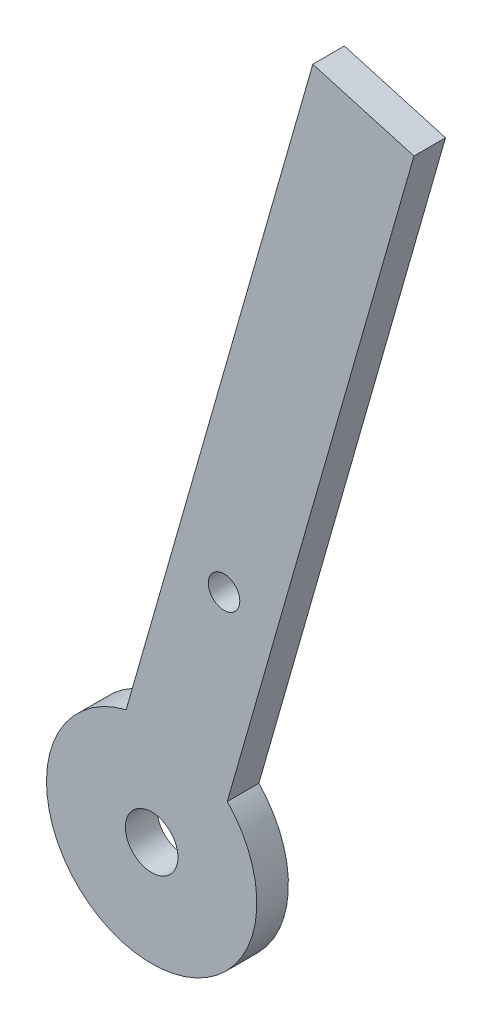
ISO-10303-21;
HEADER;
FILE_DESCRIPTION(('STEP AP214'),'2;1');
FILE_NAME('part.step','',(''),(''),'','','');
FILE_SCHEMA(('AUTOMOTIVE_DESIGN { 1 0 10303 214 1 1 1 1 }'));
ENDSEC;
DATA;
#1=APPLICATION_CONTEXT('core data for automotive mechanical design processes');
#2=APPLICATION_PROTOCOL_DEFINITION('international standard','automotive_design',2000,#1);
#3=PRODUCT_CONTEXT('',#1,'mechanical');
#4=PRODUCT('Part','Part','',(#3));
#5=PRODUCT_RELATED_PRODUCT_CATEGORY('part','',(#4));
#6=PRODUCT_DEFINITION_FORMATION('','',#4);
#7=PRODUCT_DEFINITION_CONTEXT('part definition',#1,'design');
#8=PRODUCT_DEFINITION('design','',#6,#7);
#9=PRODUCT_DEFINITION_SHAPE('','',#8);
#10=(LENGTH_UNIT() NAMED_UNIT(*) SI_UNIT(.MILLI.,.METRE.));
#11=(NAMED_UNIT(*) PLANE_ANGLE_UNIT() SI_UNIT($,.RADIAN.));
#12=(NAMED_UNIT(*) SI_UNIT($,.STERADIAN.) SOLID_ANGLE_UNIT());
#13=UNCERTAINTY_MEASURE_WITH_UNIT(LENGTH_MEASURE(1.E-05),#10,'distance_accuracy_value','');
#14=(GEOMETRIC_REPRESENTATION_CONTEXT(3) GLOBAL_UNCERTAINTY_ASSIGNED_CONTEXT((#13)) GLOBAL_UNIT_ASSIGNED_CONTEXT((#10,
#11,#12)) REPRESENTATION_CONTEXT('',''));
#15=CARTESIAN_POINT('',(0.,0.,0.));
#16=DIRECTION('',(0.,0.,1.));
#17=DIRECTION('',(1.,0.,0.));
#18=AXIS2_PLACEMENT_3D('',#15,#16,#17);
#19=CARTESIAN_POINT('',(-112.017337731008,-72.,3.));
#20=DIRECTION('',(0.,0.,1.));
#21=DIRECTION('',(1.,0.,0.));
#22=AXIS2_PLACEMENT_3D('',#19,#20,#21);
#23=PLANE('',#22);
#24=CARTESIAN_POINT('',(-112.017337731008,-72.,3.));
#25=DIRECTION('',(0.,0.,1.));
#26=DIRECTION('',(1.,0.,0.));
#27=AXIS2_PLACEMENT_3D('',#24,#25,#26);
#28=CIRCLE('',#27,2.5);
#29=CARTESIAN_POINT('',(-109.517337731008,-72.,3.));
#30=VERTEX_POINT('',#29);
#31=EDGE_CURVE('E100',#30,#30,#28,.T.);
#32=ORIENTED_EDGE('',*,*,#31,.F.);
#33=EDGE_LOOP('',(#32));
#34=FACE_BOUND('',#33,.T.);
#35=DIRECTION('',(-0.961418460482173,0.275090064967982,0.));
#36=VECTOR('',#35,1.);
#37=CARTESIAN_POINT('',(-87.0843480995858,-3.03699870488467,3.));
#38=LINE('',#37,#36);
#39=CARTESIAN_POINT('',(-87.0843480995858,-3.03699870488467,3.));
#40=VERTEX_POINT('',#39);
#41=CARTESIAN_POINT('',(-96.6985327044078,-0.286098055204756,3.));
#42=VERTEX_POINT('',#41);
#43=EDGE_CURVE('E85',#40,#42,#38,.T.);
#44=ORIENTED_EDGE('',*,*,#43,.T.);
#45=DIRECTION('',(-0.275090064967982,-0.961418460482173,0.));
#46=VECTOR('',#45,1.);
#47=CARTESIAN_POINT('',(-96.6985327044078,-0.286098055204756,3.));
#48=LINE('',#47,#46);
#49=CARTESIAN_POINT('',(-114.44208018751,-62.2984215707114,3.));
#50=VERTEX_POINT('',#49);
#51=EDGE_CURVE('E80',#42,#50,#48,.T.);
#52=ORIENTED_EDGE('',*,*,#51,.T.);
#53=CARTESIAN_POINT('',(-112.017337731008,-72.,3.));
#54=DIRECTION('',(0.,0.,1.));
#55=DIRECTION('',(1.,0.,0.));
#56=AXIS2_PLACEMENT_3D('',#53,#54,#55);
#57=CIRCLE('',#56,10.);
#58=CARTESIAN_POINT('',(-104.827895582688,-65.049322220391,3.));
#59=VERTEX_POINT('',#58);
#60=EDGE_CURVE('E83',#50,#59,#57,.T.);
#61=ORIENTED_EDGE('',*,*,#60,.T.);
#62=DIRECTION('',(0.275090064967982,0.961418460482173,0.));
#63=VECTOR('',#62,1.);
#64=CARTESIAN_POINT('',(-87.0843480995858,-3.03699870488467,3.));
#65=LINE('',#64,#63);
#66=EDGE_CURVE('E50',#59,#40,#65,.T.);
#67=ORIENTED_EDGE('',*,*,#66,.T.);
#68=EDGE_LOOP('',(#44,#52,#61,#67));
#69=FACE_BOUND('',#68,.T.);
#70=CARTESIAN_POINT('',(-105.140086106809,-47.9645384879457,3.));
#71=DIRECTION('',(0.,0.,1.));
#72=DIRECTION('',(1.,0.,0.));
#73=AXIS2_PLACEMENT_3D('',#70,#71,#72);
#74=CIRCLE('',#73,1.50000000163977);
#75=CARTESIAN_POINT('',(-103.640086105169,-47.9645384879457,3.));
#76=VERTEX_POINT('',#75);
#77=EDGE_CURVE('E115',#76,#76,#74,.T.);
#78=ORIENTED_EDGE('',*,*,#77,.F.);
#79=EDGE_LOOP('',(#78));
#80=FACE_BOUND('',#79,.T.);
#81=ADVANCED_FACE('F33',(#34,#69,#80),#23,.T.);
#82=CARTESIAN_POINT('',(-112.017337731008,-72.,0.));
#83=DIRECTION('',(0.,0.,1.));
#84=DIRECTION('',(1.,0.,0.));
#85=AXIS2_PLACEMENT_3D('',#82,#83,#84);
#86=PLANE('',#85);
#87=DIRECTION('',(-0.961418460482173,0.275090064967982,0.));
#88=VECTOR('',#87,1.);
#89=CARTESIAN_POINT('',(-87.0843480995858,-3.03699870488467,0.));
#90=LINE('',#89,#88);
#91=CARTESIAN_POINT('',(-87.0843480995858,-3.03699870488467,0.));
#92=VERTEX_POINT('',#91);
#93=CARTESIAN_POINT('',(-96.6985327044078,-0.286098055204756,0.));
#94=VERTEX_POINT('',#93);
#95=EDGE_CURVE('E97',#92,#94,#90,.T.);
#96=ORIENTED_EDGE('',*,*,#95,.F.);
#97=DIRECTION('',(0.275090064967982,0.961418460482173,0.));
#98=VECTOR('',#97,1.);
#99=CARTESIAN_POINT('',(-87.0843480995858,-3.03699870488467,0.));
#100=LINE('',#99,#98);
#101=CARTESIAN_POINT('',(-104.827895582688,-65.049322220391,0.));
#102=VERTEX_POINT('',#101);
#103=EDGE_CURVE('E73',#102,#92,#100,.T.);
#104=ORIENTED_EDGE('',*,*,#103,.F.);
#105=CARTESIAN_POINT('',(-112.017337731008,-72.,0.));
#106=DIRECTION('',(0.,0.,1.));
#107=DIRECTION('',(1.,0.,0.));
#108=AXIS2_PLACEMENT_3D('',#105,#106,#107);
#109=CIRCLE('',#108,10.);
#110=CARTESIAN_POINT('',(-114.44208018751,-62.2984215707114,0.));
#111=VERTEX_POINT('',#110);
#112=EDGE_CURVE('E67',#111,#102,#109,.T.);
#113=ORIENTED_EDGE('',*,*,#112,.F.);
#114=DIRECTION('',(-0.275090064967982,-0.961418460482173,0.));
#115=VECTOR('',#114,1.);
#116=CARTESIAN_POINT('',(-96.6985327044078,-0.286098055204756,0.));
#117=LINE('',#116,#115);
#118=EDGE_CURVE('E89',#94,#111,#117,.T.);
#119=ORIENTED_EDGE('',*,*,#118,.F.);
#120=EDGE_LOOP('',(#96,#104,#113,#119));
#121=FACE_BOUND('',#120,.T.);
#122=CARTESIAN_POINT('',(-112.017337731008,-72.,0.));
#123=DIRECTION('',(0.,0.,1.));
#124=DIRECTION('',(1.,0.,0.));
#125=AXIS2_PLACEMENT_3D('',#122,#123,#124);
#126=CIRCLE('',#125,2.5);
#127=CARTESIAN_POINT('',(-109.517337731008,-72.,0.));
#128=VERTEX_POINT('',#127);
#129=EDGE_CURVE('E112',#128,#128,#126,.T.);
#130=ORIENTED_EDGE('',*,*,#129,.T.);
#131=EDGE_LOOP('',(#130));
#132=FACE_BOUND('',#131,.T.);
#133=CARTESIAN_POINT('',(-105.140086106809,-47.9645384879457,0.));
#134=DIRECTION('',(0.,0.,1.));
#135=DIRECTION('',(1.,0.,0.));
#136=AXIS2_PLACEMENT_3D('',#133,#134,#135);
#137=CIRCLE('',#136,1.50000000163977);
#138=CARTESIAN_POINT('',(-103.640086105169,-47.9645384879457,0.));
#139=VERTEX_POINT('',#138);
#140=EDGE_CURVE('E118',#139,#139,#137,.T.);
#141=ORIENTED_EDGE('',*,*,#140,.T.);
#142=EDGE_LOOP('',(#141));
#143=FACE_BOUND('',#142,.T.);
#144=ADVANCED_FACE('F108',(#121,#132,#143),#86,.F.);
#145=CARTESIAN_POINT('',(-87.0843480995858,-3.03699870488467,3.));
#146=DIRECTION('',(-0.275090064967982,-0.961418460482173,0.));
#147=DIRECTION('',(0.961418460482173,-0.275090064967982,0.));
#148=AXIS2_PLACEMENT_3D('',#145,#146,#147);
#149=PLANE('',#148);
#150=ORIENTED_EDGE('',*,*,#95,.T.);
#151=DIRECTION('',(0.,0.,-1.));
#152=VECTOR('',#151,1.);
#153=CARTESIAN_POINT('',(-96.6985327044078,-0.286098055204756,3.));
#154=LINE('',#153,#152);
#155=EDGE_CURVE('E11',#42,#94,#154,.T.);
#156=ORIENTED_EDGE('',*,*,#155,.F.);
#157=ORIENTED_EDGE('',*,*,#43,.F.);
#158=DIRECTION('',(0.,0.,-1.));
#159=VECTOR('',#158,1.);
#160=CARTESIAN_POINT('',(-87.0843480995858,-3.03699870488467,3.));
#161=LINE('',#160,#159);
#162=EDGE_CURVE('E93',#40,#92,#161,.T.);
#163=ORIENTED_EDGE('',*,*,#162,.T.);
#164=EDGE_LOOP('',(#150,#156,#157,#163));
#165=FACE_BOUND('',#164,.T.);
#166=ADVANCED_FACE('F35',(#165),#149,.F.);
#167=CARTESIAN_POINT('',(-96.6985327044078,-0.286098055204756,3.));
#168=DIRECTION('',(0.961418460482173,-0.275090064967982,0.));
#169=DIRECTION('',(0.275090064967982,0.961418460482173,0.));
#170=AXIS2_PLACEMENT_3D('',#167,#168,#169);
#171=PLANE('',#170);
#172=ORIENTED_EDGE('',*,*,#118,.T.);
#173=DIRECTION('',(0.,0.,-1.));
#174=VECTOR('',#173,1.);
#175=CARTESIAN_POINT('',(-114.44208018751,-62.2984215707114,3.));
#176=LINE('',#175,#174);
#177=EDGE_CURVE('E42',#50,#111,#176,.T.);
#178=ORIENTED_EDGE('',*,*,#177,.F.);
#179=ORIENTED_EDGE('',*,*,#51,.F.);
#180=ORIENTED_EDGE('',*,*,#155,.T.);
#181=EDGE_LOOP('',(#172,#178,#179,#180));
#182=FACE_BOUND('',#181,.T.);
#183=ADVANCED_FACE('F88',(#182),#171,.F.);
#184=CARTESIAN_POINT('',(-112.017337731008,-72.,3.));
#185=DIRECTION('',(0.,0.,-1.));
#186=DIRECTION('',(-1.,0.,0.));
#187=AXIS2_PLACEMENT_3D('',#184,#185,#186);
#188=CYLINDRICAL_SURFACE('',#187,10.);
#189=ORIENTED_EDGE('',*,*,#112,.T.);
#190=DIRECTION('',(0.,0.,-1.));
#191=VECTOR('',#190,1.);
#192=CARTESIAN_POINT('',(-104.827895582688,-65.049322220391,3.));
#193=LINE('',#192,#191);
#194=EDGE_CURVE('E90',#59,#102,#193,.T.);
#195=ORIENTED_EDGE('',*,*,#194,.F.);
#196=ORIENTED_EDGE('',*,*,#60,.F.);
#197=ORIENTED_EDGE('',*,*,#177,.T.);
#198=EDGE_LOOP('',(#189,#195,#196,#197));
#199=FACE_BOUND('',#198,.T.);
#200=ADVANCED_FACE('F91',(#199),#188,.T.);
#201=CARTESIAN_POINT('',(-87.0843480995858,-3.03699870488467,3.));
#202=DIRECTION('',(-0.961418460482173,0.275090064967982,0.));
#203=DIRECTION('',(-0.275090064967982,-0.961418460482173,0.));
#204=AXIS2_PLACEMENT_3D('',#201,#202,#203);
#205=PLANE('',#204);
#206=ORIENTED_EDGE('',*,*,#103,.T.);
#207=ORIENTED_EDGE('',*,*,#162,.F.);
#208=ORIENTED_EDGE('',*,*,#66,.F.);
#209=ORIENTED_EDGE('',*,*,#194,.T.);
#210=EDGE_LOOP('',(#206,#207,#208,#209));
#211=FACE_BOUND('',#210,.T.);
#212=ADVANCED_FACE('F105',(#211),#205,.F.);
#213=CARTESIAN_POINT('',(-112.017337731008,-72.,3.));
#214=DIRECTION('',(0.,0.,-1.));
#215=DIRECTION('',(-1.,0.,0.));
#216=AXIS2_PLACEMENT_3D('',#213,#214,#215);
#217=CYLINDRICAL_SURFACE('',#216,2.5);
#218=ORIENTED_EDGE('',*,*,#31,.T.);
#219=EDGE_LOOP('',(#218));
#220=FACE_BOUND('',#219,.T.);
#221=ORIENTED_EDGE('',*,*,#129,.F.);
#222=EDGE_LOOP('',(#221));
#223=FACE_BOUND('',#222,.T.);
#224=ADVANCED_FACE('F135',(#220,#223),#217,.F.);
#225=CARTESIAN_POINT('',(-105.140086106809,-47.9645384879457,3.));
#226=DIRECTION('',(0.,0.,-1.));
#227=DIRECTION('',(-1.,0.,0.));
#228=AXIS2_PLACEMENT_3D('',#225,#226,#227);
#229=CYLINDRICAL_SURFACE('',#228,1.50000000163977);
#230=ORIENTED_EDGE('',*,*,#77,.T.);
#231=EDGE_LOOP('',(#230));
#232=FACE_BOUND('',#231,.T.);
#233=ORIENTED_EDGE('',*,*,#140,.F.);
#234=EDGE_LOOP('',(#233));
#235=FACE_BOUND('',#234,.T.);
#236=ADVANCED_FACE('F124',(#232,#235),#229,.F.);
#237=CLOSED_SHELL('',(#81,#144,#166,#183,#200,#212,#224,#236));
#238=MANIFOLD_SOLID_BREP('B2',#237);
#239=ADVANCED_BREP_SHAPE_REPRESENTATION('',(#18,#238),#14);
#240=SHAPE_DEFINITION_REPRESENTATION(#9,#239);
ENDSEC;
END-ISO-10303-21;
